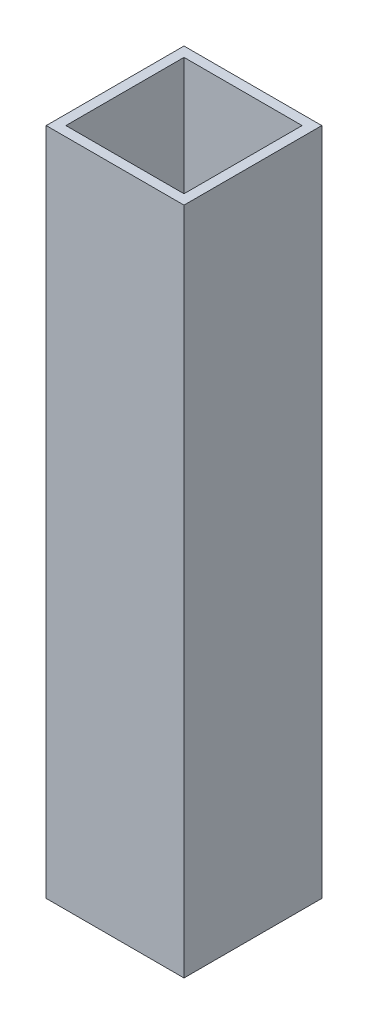
ISO-10303-21;
HEADER;
FILE_DESCRIPTION(('STEP AP214'),'2;1');
FILE_NAME('part.step','',(''),(''),'','','');
FILE_SCHEMA(('AUTOMOTIVE_DESIGN { 1 0 10303 214 1 1 1 1 }'));
ENDSEC;
DATA;
#1=APPLICATION_CONTEXT('core data for automotive mechanical design processes');
#2=APPLICATION_PROTOCOL_DEFINITION('international standard','automotive_design',2000,#1);
#3=PRODUCT_CONTEXT('',#1,'mechanical');
#4=PRODUCT('Part','Part','',(#3));
#5=PRODUCT_RELATED_PRODUCT_CATEGORY('part','',(#4));
#6=PRODUCT_DEFINITION_FORMATION('','',#4);
#7=PRODUCT_DEFINITION_CONTEXT('part definition',#1,'design');
#8=PRODUCT_DEFINITION('design','',#6,#7);
#9=PRODUCT_DEFINITION_SHAPE('','',#8);
#10=(LENGTH_UNIT() NAMED_UNIT(*) SI_UNIT(.MILLI.,.METRE.));
#11=(NAMED_UNIT(*) PLANE_ANGLE_UNIT() SI_UNIT($,.RADIAN.));
#12=(NAMED_UNIT(*) SI_UNIT($,.STERADIAN.) SOLID_ANGLE_UNIT());
#13=UNCERTAINTY_MEASURE_WITH_UNIT(LENGTH_MEASURE(1.E-05),#10,'distance_accuracy_value','');
#14=(GEOMETRIC_REPRESENTATION_CONTEXT(3) GLOBAL_UNCERTAINTY_ASSIGNED_CONTEXT((#13)) GLOBAL_UNIT_ASSIGNED_CONTEXT((#10,
#11,#12)) REPRESENTATION_CONTEXT('',''));
#15=CARTESIAN_POINT('',(0.,0.,0.));
#16=DIRECTION('',(0.,0.,1.));
#17=DIRECTION('',(1.,0.,0.));
#18=AXIS2_PLACEMENT_3D('',#15,#16,#17);
#19=CARTESIAN_POINT('',(-22.225,-215.9,-3.175));
#20=DIRECTION('',(0.,0.,-1.));
#21=DIRECTION('',(-1.,0.,0.));
#22=AXIS2_PLACEMENT_3D('',#19,#20,#21);
#23=PLANE('',#22);
#24=DIRECTION('',(1.,0.,0.));
#25=VECTOR('',#24,1.);
#26=CARTESIAN_POINT('',(-22.225,-215.9,-3.175));
#27=LINE('',#26,#25);
#28=CARTESIAN_POINT('',(-41.275,-215.9,-3.175));
#29=VERTEX_POINT('',#28);
#30=CARTESIAN_POINT('',(-3.175,-215.9,-3.175));
#31=VERTEX_POINT('',#30);
#32=EDGE_CURVE('E131',#29,#31,#27,.T.);
#33=ORIENTED_EDGE('',*,*,#32,.F.);
#34=DIRECTION('',(0.,1.,0.));
#35=VECTOR('',#34,1.);
#36=CARTESIAN_POINT('',(-41.275,-215.9,-3.175));
#37=LINE('',#36,#35);
#38=CARTESIAN_POINT('',(-41.275,0.,-3.175));
#39=VERTEX_POINT('',#38);
#40=EDGE_CURVE('E107',#39,#29,#37,.F.);
#41=ORIENTED_EDGE('',*,*,#40,.F.);
#42=DIRECTION('',(1.,0.,0.));
#43=VECTOR('',#42,1.);
#44=CARTESIAN_POINT('',(-22.225,0.,-3.175));
#45=LINE('',#44,#43);
#46=CARTESIAN_POINT('',(-3.175,0.,-3.175));
#47=VERTEX_POINT('',#46);
#48=EDGE_CURVE('E114',#39,#47,#45,.T.);
#49=ORIENTED_EDGE('',*,*,#48,.T.);
#50=DIRECTION('',(0.,1.,0.));
#51=VECTOR('',#50,1.);
#52=CARTESIAN_POINT('',(-3.17500000000001,-215.9,-3.175));
#53=LINE('',#52,#51);
#54=EDGE_CURVE('E19',#47,#31,#53,.F.);
#55=ORIENTED_EDGE('',*,*,#54,.T.);
#56=EDGE_LOOP('',(#33,#41,#49,#55));
#57=FACE_BOUND('',#56,.T.);
#58=ADVANCED_FACE('F16',(#57),#23,.T.);
#59=CARTESIAN_POINT('',(-3.175,-215.9,-22.225));
#60=DIRECTION('',(1.,0.,0.));
#61=DIRECTION('',(0.,0.,-1.));
#62=AXIS2_PLACEMENT_3D('',#59,#60,#61);
#63=PLANE('',#62);
#64=DIRECTION('',(0.,1.,0.));
#65=VECTOR('',#64,1.);
#66=CARTESIAN_POINT('',(-3.175,-215.9,-41.275));
#67=LINE('',#66,#65);
#68=CARTESIAN_POINT('',(-3.175,0.,-41.275));
#69=VERTEX_POINT('',#68);
#70=CARTESIAN_POINT('',(-3.175,-215.9,-41.275));
#71=VERTEX_POINT('',#70);
#72=EDGE_CURVE('E93',#69,#71,#67,.F.);
#73=ORIENTED_EDGE('',*,*,#72,.T.);
#74=DIRECTION('',(0.,0.,-1.));
#75=VECTOR('',#74,1.);
#76=CARTESIAN_POINT('',(-3.175,-215.9,-22.225));
#77=LINE('',#76,#75);
#78=EDGE_CURVE('E140',#31,#71,#77,.T.);
#79=ORIENTED_EDGE('',*,*,#78,.F.);
#80=ORIENTED_EDGE('',*,*,#54,.F.);
#81=DIRECTION('',(0.,0.,-1.));
#82=VECTOR('',#81,1.);
#83=CARTESIAN_POINT('',(-3.175,0.,-22.225));
#84=LINE('',#83,#82);
#85=EDGE_CURVE('E90',#47,#69,#84,.T.);
#86=ORIENTED_EDGE('',*,*,#85,.T.);
#87=EDGE_LOOP('',(#73,#79,#80,#86));
#88=FACE_BOUND('',#87,.T.);
#89=ADVANCED_FACE('F92',(#88),#63,.F.);
#90=CARTESIAN_POINT('',(-22.225,-215.9,-41.275));
#91=DIRECTION('',(0.,0.,-1.));
#92=DIRECTION('',(-1.,0.,0.));
#93=AXIS2_PLACEMENT_3D('',#90,#91,#92);
#94=PLANE('',#93);
#95=DIRECTION('',(0.,1.,0.));
#96=VECTOR('',#95,1.);
#97=CARTESIAN_POINT('',(-41.275,-215.9,-41.275));
#98=LINE('',#97,#96);
#99=CARTESIAN_POINT('',(-41.275,-215.9,-41.275));
#100=VERTEX_POINT('',#99);
#101=CARTESIAN_POINT('',(-41.275,0.,-41.275));
#102=VERTEX_POINT('',#101);
#103=EDGE_CURVE('E119',#100,#102,#98,.T.);
#104=ORIENTED_EDGE('',*,*,#103,.F.);
#105=DIRECTION('',(1.,0.,0.));
#106=VECTOR('',#105,1.);
#107=CARTESIAN_POINT('',(-22.225,-215.9,-41.275));
#108=LINE('',#107,#106);
#109=EDGE_CURVE('E105',#71,#100,#108,.F.);
#110=ORIENTED_EDGE('',*,*,#109,.F.);
#111=ORIENTED_EDGE('',*,*,#72,.F.);
#112=DIRECTION('',(1.,0.,0.));
#113=VECTOR('',#112,1.);
#114=CARTESIAN_POINT('',(-22.225,0.,-41.275));
#115=LINE('',#114,#113);
#116=EDGE_CURVE('E98',#69,#102,#115,.F.);
#117=ORIENTED_EDGE('',*,*,#116,.T.);
#118=EDGE_LOOP('',(#104,#110,#111,#117));
#119=FACE_BOUND('',#118,.T.);
#120=ADVANCED_FACE('F102',(#119),#94,.F.);
#121=CARTESIAN_POINT('',(-41.275,-215.9,-22.225));
#122=DIRECTION('',(1.,0.,0.));
#123=DIRECTION('',(0.,0.,-1.));
#124=AXIS2_PLACEMENT_3D('',#121,#122,#123);
#125=PLANE('',#124);
#126=DIRECTION('',(0.,0.,-1.));
#127=VECTOR('',#126,1.);
#128=CARTESIAN_POINT('',(-41.275,-215.9,-22.225));
#129=LINE('',#128,#127);
#130=EDGE_CURVE('E126',#100,#29,#129,.F.);
#131=ORIENTED_EDGE('',*,*,#130,.F.);
#132=ORIENTED_EDGE('',*,*,#103,.T.);
#133=DIRECTION('',(0.,0.,-1.));
#134=VECTOR('',#133,1.);
#135=CARTESIAN_POINT('',(-41.275,0.,-22.225));
#136=LINE('',#135,#134);
#137=EDGE_CURVE('E112',#102,#39,#136,.F.);
#138=ORIENTED_EDGE('',*,*,#137,.T.);
#139=ORIENTED_EDGE('',*,*,#40,.T.);
#140=EDGE_LOOP('',(#131,#132,#138,#139));
#141=FACE_BOUND('',#140,.T.);
#142=ADVANCED_FACE('F125',(#141),#125,.T.);
#143=CARTESIAN_POINT('',(-22.225,-215.9,0.));
#144=DIRECTION('',(0.,0.,-1.));
#145=DIRECTION('',(-1.,0.,0.));
#146=AXIS2_PLACEMENT_3D('',#143,#144,#145);
#147=PLANE('',#146);
#148=DIRECTION('',(0.,1.,0.));
#149=VECTOR('',#148,1.);
#150=CARTESIAN_POINT('',(-44.45,-215.9,0.));
#151=LINE('',#150,#149);
#152=CARTESIAN_POINT('',(-44.45,0.,0.));
#153=VERTEX_POINT('',#152);
#154=CARTESIAN_POINT('',(-44.45,-215.9,0.));
#155=VERTEX_POINT('',#154);
#156=EDGE_CURVE('E133',#153,#155,#151,.F.);
#157=ORIENTED_EDGE('',*,*,#156,.T.);
#158=DIRECTION('',(1.,0.,0.));
#159=VECTOR('',#158,1.);
#160=CARTESIAN_POINT('',(-22.225,-215.9,0.));
#161=LINE('',#160,#159);
#162=CARTESIAN_POINT('',(0.,-215.9,0.));
#163=VERTEX_POINT('',#162);
#164=EDGE_CURVE('E147',#163,#155,#161,.F.);
#165=ORIENTED_EDGE('',*,*,#164,.F.);
#166=DIRECTION('',(0.,1.,0.));
#167=VECTOR('',#166,1.);
#168=CARTESIAN_POINT('',(0.,-215.9,0.));
#169=LINE('',#168,#167);
#170=CARTESIAN_POINT('',(0.,0.,0.));
#171=VERTEX_POINT('',#170);
#172=EDGE_CURVE('E154',#171,#163,#169,.F.);
#173=ORIENTED_EDGE('',*,*,#172,.F.);
#174=DIRECTION('',(1.,0.,0.));
#175=VECTOR('',#174,1.);
#176=CARTESIAN_POINT('',(-22.225,0.,0.));
#177=LINE('',#176,#175);
#178=EDGE_CURVE('E99',#171,#153,#177,.F.);
#179=ORIENTED_EDGE('',*,*,#178,.T.);
#180=EDGE_LOOP('',(#157,#165,#173,#179));
#181=FACE_BOUND('',#180,.T.);
#182=ADVANCED_FACE('F183',(#181),#147,.F.);
#183=CARTESIAN_POINT('',(-22.225,0.,-22.225));
#184=DIRECTION('',(0.,-1.,0.));
#185=DIRECTION('',(0.,0.,-1.));
#186=AXIS2_PLACEMENT_3D('',#183,#184,#185);
#187=PLANE('',#186);
#188=ORIENTED_EDGE('',*,*,#137,.F.);
#189=ORIENTED_EDGE('',*,*,#116,.F.);
#190=ORIENTED_EDGE('',*,*,#85,.F.);
#191=ORIENTED_EDGE('',*,*,#48,.F.);
#192=EDGE_LOOP('',(#188,#189,#190,#191));
#193=FACE_BOUND('',#192,.T.);
#194=DIRECTION('',(-1.,0.,0.));
#195=VECTOR('',#194,1.);
#196=CARTESIAN_POINT('',(-22.225,0.,-44.45));
#197=LINE('',#196,#195);
#198=CARTESIAN_POINT('',(-44.45,0.,-44.45));
#199=VERTEX_POINT('',#198);
#200=CARTESIAN_POINT('',(0.,0.,-44.45));
#201=VERTEX_POINT('',#200);
#202=EDGE_CURVE('E259',#199,#201,#197,.F.);
#203=ORIENTED_EDGE('',*,*,#202,.F.);
#204=DIRECTION('',(0.,0.,-1.));
#205=VECTOR('',#204,1.);
#206=CARTESIAN_POINT('',(-44.45,0.,-22.225));
#207=LINE('',#206,#205);
#208=EDGE_CURVE('E258',#199,#153,#207,.F.);
#209=ORIENTED_EDGE('',*,*,#208,.T.);
#210=ORIENTED_EDGE('',*,*,#178,.F.);
#211=DIRECTION('',(0.,0.,-1.));
#212=VECTOR('',#211,1.);
#213=CARTESIAN_POINT('',(0.,0.,-22.225));
#214=LINE('',#213,#212);
#215=EDGE_CURVE('E156',#201,#171,#214,.F.);
#216=ORIENTED_EDGE('',*,*,#215,.F.);
#217=EDGE_LOOP('',(#203,#209,#210,#216));
#218=FACE_BOUND('',#217,.T.);
#219=ADVANCED_FACE('F109',(#193,#218),#187,.F.);
#220=CARTESIAN_POINT('',(0.,-215.9,-22.225));
#221=DIRECTION('',(1.,0.,0.));
#222=DIRECTION('',(0.,0.,-1.));
#223=AXIS2_PLACEMENT_3D('',#220,#221,#222);
#224=PLANE('',#223);
#225=DIRECTION('',(0.,0.,-1.));
#226=VECTOR('',#225,1.);
#227=CARTESIAN_POINT('',(0.,-215.9,-22.225));
#228=LINE('',#227,#226);
#229=CARTESIAN_POINT('',(0.,-215.9,-44.45));
#230=VERTEX_POINT('',#229);
#231=EDGE_CURVE('E150',#230,#163,#228,.F.);
#232=ORIENTED_EDGE('',*,*,#231,.F.);
#233=DIRECTION('',(0.,1.,0.));
#234=VECTOR('',#233,1.);
#235=CARTESIAN_POINT('',(0.,-215.9,-44.45));
#236=LINE('',#235,#234);
#237=EDGE_CURVE('E264',#201,#230,#236,.F.);
#238=ORIENTED_EDGE('',*,*,#237,.F.);
#239=ORIENTED_EDGE('',*,*,#215,.T.);
#240=ORIENTED_EDGE('',*,*,#172,.T.);
#241=EDGE_LOOP('',(#232,#238,#239,#240));
#242=FACE_BOUND('',#241,.T.);
#243=ADVANCED_FACE('F177',(#242),#224,.T.);
#244=CARTESIAN_POINT('',(-22.225,-215.9,-22.225));
#245=DIRECTION('',(0.,-1.,0.));
#246=DIRECTION('',(0.,0.,-1.));
#247=AXIS2_PLACEMENT_3D('',#244,#245,#246);
#248=PLANE('',#247);
#249=ORIENTED_EDGE('',*,*,#109,.T.);
#250=ORIENTED_EDGE('',*,*,#130,.T.);
#251=ORIENTED_EDGE('',*,*,#32,.T.);
#252=ORIENTED_EDGE('',*,*,#78,.T.);
#253=EDGE_LOOP('',(#249,#250,#251,#252));
#254=FACE_BOUND('',#253,.T.);
#255=DIRECTION('',(0.,0.,-1.));
#256=VECTOR('',#255,1.);
#257=CARTESIAN_POINT('',(-44.45,-215.9,-22.225));
#258=LINE('',#257,#256);
#259=CARTESIAN_POINT('',(-44.45,-215.9,-44.45));
#260=VERTEX_POINT('',#259);
#261=EDGE_CURVE('E38',#155,#260,#258,.T.);
#262=ORIENTED_EDGE('',*,*,#261,.T.);
#263=DIRECTION('',(-1.,0.,0.));
#264=VECTOR('',#263,1.);
#265=CARTESIAN_POINT('',(-22.225,-215.9,-44.45));
#266=LINE('',#265,#264);
#267=EDGE_CURVE('E25',#230,#260,#266,.T.);
#268=ORIENTED_EDGE('',*,*,#267,.F.);
#269=ORIENTED_EDGE('',*,*,#231,.T.);
#270=ORIENTED_EDGE('',*,*,#164,.T.);
#271=EDGE_LOOP('',(#262,#268,#269,#270));
#272=FACE_BOUND('',#271,.T.);
#273=ADVANCED_FACE('F130',(#254,#272),#248,.T.);
#274=CARTESIAN_POINT('',(-44.45,-215.9,-22.225));
#275=DIRECTION('',(1.,0.,0.));
#276=DIRECTION('',(0.,0.,-1.));
#277=AXIS2_PLACEMENT_3D('',#274,#275,#276);
#278=PLANE('',#277);
#279=DIRECTION('',(0.,1.,0.));
#280=VECTOR('',#279,1.);
#281=CARTESIAN_POINT('',(-44.45,-215.9,-44.45));
#282=LINE('',#281,#280);
#283=EDGE_CURVE('E11',#260,#199,#282,.T.);
#284=ORIENTED_EDGE('',*,*,#283,.F.);
#285=ORIENTED_EDGE('',*,*,#261,.F.);
#286=ORIENTED_EDGE('',*,*,#156,.F.);
#287=ORIENTED_EDGE('',*,*,#208,.F.);
#288=EDGE_LOOP('',(#284,#285,#286,#287));
#289=FACE_BOUND('',#288,.T.);
#290=ADVANCED_FACE('F165',(#289),#278,.F.);
#291=CARTESIAN_POINT('',(-22.225,-215.9,-44.45));
#292=DIRECTION('',(0.,0.,-1.));
#293=DIRECTION('',(-1.,0.,0.));
#294=AXIS2_PLACEMENT_3D('',#291,#292,#293);
#295=PLANE('',#294);
#296=ORIENTED_EDGE('',*,*,#267,.T.);
#297=ORIENTED_EDGE('',*,*,#283,.T.);
#298=ORIENTED_EDGE('',*,*,#202,.T.);
#299=ORIENTED_EDGE('',*,*,#237,.T.);
#300=EDGE_LOOP('',(#296,#297,#298,#299));
#301=FACE_BOUND('',#300,.T.);
#302=ADVANCED_FACE('F163',(#301),#295,.T.);
#303=CLOSED_SHELL('',(#58,#89,#120,#142,#182,#219,#243,#273,#290,#302));
#304=MANIFOLD_SOLID_BREP('B1',#303);
#305=ADVANCED_BREP_SHAPE_REPRESENTATION('',(#18,#304),#14);
#306=SHAPE_DEFINITION_REPRESENTATION(#9,#305);
ENDSEC;
END-ISO-10303-21;
